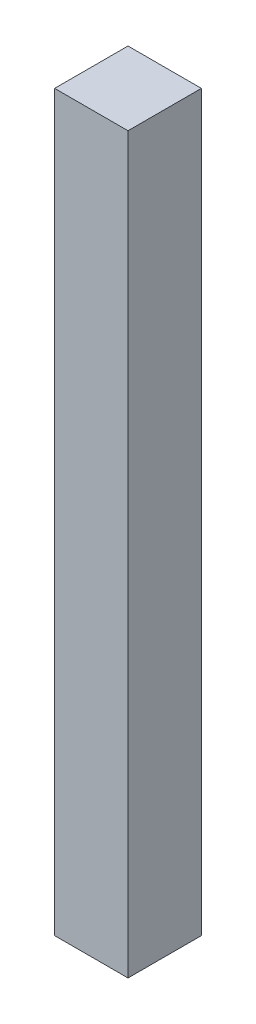
ISO-10303-21;
HEADER;
FILE_DESCRIPTION(('STEP AP214'),'2;1');
FILE_NAME('part.step','',(''),(''),'','','');
FILE_SCHEMA(('AUTOMOTIVE_DESIGN { 1 0 10303 214 1 1 1 1 }'));
ENDSEC;
DATA;
#1=APPLICATION_CONTEXT('core data for automotive mechanical design processes');
#2=APPLICATION_PROTOCOL_DEFINITION('international standard','automotive_design',2000,#1);
#3=PRODUCT_CONTEXT('',#1,'mechanical');
#4=PRODUCT('Part','Part','',(#3));
#5=PRODUCT_RELATED_PRODUCT_CATEGORY('part','',(#4));
#6=PRODUCT_DEFINITION_FORMATION('','',#4);
#7=PRODUCT_DEFINITION_CONTEXT('part definition',#1,'design');
#8=PRODUCT_DEFINITION('design','',#6,#7);
#9=PRODUCT_DEFINITION_SHAPE('','',#8);
#10=(LENGTH_UNIT() NAMED_UNIT(*) SI_UNIT(.MILLI.,.METRE.));
#11=(NAMED_UNIT(*) PLANE_ANGLE_UNIT() SI_UNIT($,.RADIAN.));
#12=(NAMED_UNIT(*) SI_UNIT($,.STERADIAN.) SOLID_ANGLE_UNIT());
#13=UNCERTAINTY_MEASURE_WITH_UNIT(LENGTH_MEASURE(1.E-05),#10,'distance_accuracy_value','');
#14=(GEOMETRIC_REPRESENTATION_CONTEXT(3) GLOBAL_UNCERTAINTY_ASSIGNED_CONTEXT((#13)) GLOBAL_UNIT_ASSIGNED_CONTEXT((#10,
#11,#12)) REPRESENTATION_CONTEXT('',''));
#15=CARTESIAN_POINT('',(0.,0.,0.));
#16=DIRECTION('',(0.,0.,1.));
#17=DIRECTION('',(1.,0.,0.));
#18=AXIS2_PLACEMENT_3D('',#15,#16,#17);
#19=CARTESIAN_POINT('',(0.,1000.,0.));
#20=DIRECTION('',(1.,0.,0.));
#21=DIRECTION('',(0.,0.,-1.));
#22=AXIS2_PLACEMENT_3D('',#19,#20,#21);
#23=PLANE('',#22);
#24=DIRECTION('',(0.,0.,1.));
#25=VECTOR('',#24,1.);
#26=CARTESIAN_POINT('',(0.,0.,0.));
#27=LINE('',#26,#25);
#28=CARTESIAN_POINT('',(0.,0.,-100.));
#29=VERTEX_POINT('',#28);
#30=CARTESIAN_POINT('',(0.,0.,0.));
#31=VERTEX_POINT('',#30);
#32=EDGE_CURVE('E96',#29,#31,#27,.T.);
#33=ORIENTED_EDGE('',*,*,#32,.T.);
#34=DIRECTION('',(0.,-1.,0.));
#35=VECTOR('',#34,1.);
#36=CARTESIAN_POINT('',(0.,1000.,0.));
#37=LINE('',#36,#35);
#38=CARTESIAN_POINT('',(0.,1000.,0.));
#39=VERTEX_POINT('',#38);
#40=EDGE_CURVE('E11',#39,#31,#37,.T.);
#41=ORIENTED_EDGE('',*,*,#40,.F.);
#42=DIRECTION('',(0.,0.,1.));
#43=VECTOR('',#42,1.);
#44=CARTESIAN_POINT('',(0.,1000.,0.));
#45=LINE('',#44,#43);
#46=CARTESIAN_POINT('',(0.,1000.,-100.));
#47=VERTEX_POINT('',#46);
#48=EDGE_CURVE('E84',#47,#39,#45,.T.);
#49=ORIENTED_EDGE('',*,*,#48,.F.);
#50=DIRECTION('',(0.,-1.,0.));
#51=VECTOR('',#50,1.);
#52=CARTESIAN_POINT('',(0.,1000.,-100.));
#53=LINE('',#52,#51);
#54=EDGE_CURVE('E92',#47,#29,#53,.T.);
#55=ORIENTED_EDGE('',*,*,#54,.T.);
#56=EDGE_LOOP('',(#33,#41,#49,#55));
#57=FACE_BOUND('',#56,.T.);
#58=ADVANCED_FACE('F33',(#57),#23,.F.);
#59=CARTESIAN_POINT('',(0.,1000.,0.));
#60=DIRECTION('',(0.,0.,-1.));
#61=DIRECTION('',(-1.,0.,0.));
#62=AXIS2_PLACEMENT_3D('',#59,#60,#61);
#63=PLANE('',#62);
#64=DIRECTION('',(1.,0.,0.));
#65=VECTOR('',#64,1.);
#66=CARTESIAN_POINT('',(0.,0.,0.));
#67=LINE('',#66,#65);
#68=CARTESIAN_POINT('',(100.,0.,0.));
#69=VERTEX_POINT('',#68);
#70=EDGE_CURVE('E88',#31,#69,#67,.T.);
#71=ORIENTED_EDGE('',*,*,#70,.T.);
#72=DIRECTION('',(0.,-1.,0.));
#73=VECTOR('',#72,1.);
#74=CARTESIAN_POINT('',(100.,1000.,0.));
#75=LINE('',#74,#73);
#76=CARTESIAN_POINT('',(100.,1000.,0.));
#77=VERTEX_POINT('',#76);
#78=EDGE_CURVE('E41',#77,#69,#75,.T.);
#79=ORIENTED_EDGE('',*,*,#78,.F.);
#80=DIRECTION('',(1.,0.,0.));
#81=VECTOR('',#80,1.);
#82=CARTESIAN_POINT('',(0.,1000.,0.));
#83=LINE('',#82,#81);
#84=EDGE_CURVE('E79',#39,#77,#83,.T.);
#85=ORIENTED_EDGE('',*,*,#84,.F.);
#86=ORIENTED_EDGE('',*,*,#40,.T.);
#87=EDGE_LOOP('',(#71,#79,#85,#86));
#88=FACE_BOUND('',#87,.T.);
#89=ADVANCED_FACE('F87',(#88),#63,.F.);
#90=CARTESIAN_POINT('',(100.,1000.,0.));
#91=DIRECTION('',(-1.,0.,0.));
#92=DIRECTION('',(0.,0.,1.));
#93=AXIS2_PLACEMENT_3D('',#90,#91,#92);
#94=PLANE('',#93);
#95=DIRECTION('',(0.,0.,-1.));
#96=VECTOR('',#95,1.);
#97=CARTESIAN_POINT('',(100.,0.,0.));
#98=LINE('',#97,#96);
#99=CARTESIAN_POINT('',(100.,0.,-100.));
#100=VERTEX_POINT('',#99);
#101=EDGE_CURVE('E66',#69,#100,#98,.T.);
#102=ORIENTED_EDGE('',*,*,#101,.T.);
#103=DIRECTION('',(0.,-1.,0.));
#104=VECTOR('',#103,1.);
#105=CARTESIAN_POINT('',(100.,1000.,-100.));
#106=LINE('',#105,#104);
#107=CARTESIAN_POINT('',(100.,1000.,-100.));
#108=VERTEX_POINT('',#107);
#109=EDGE_CURVE('E89',#108,#100,#106,.T.);
#110=ORIENTED_EDGE('',*,*,#109,.F.);
#111=DIRECTION('',(0.,0.,-1.));
#112=VECTOR('',#111,1.);
#113=CARTESIAN_POINT('',(100.,1000.,0.));
#114=LINE('',#113,#112);
#115=EDGE_CURVE('E82',#77,#108,#114,.T.);
#116=ORIENTED_EDGE('',*,*,#115,.F.);
#117=ORIENTED_EDGE('',*,*,#78,.T.);
#118=EDGE_LOOP('',(#102,#110,#116,#117));
#119=FACE_BOUND('',#118,.T.);
#120=ADVANCED_FACE('F90',(#119),#94,.F.);
#121=CARTESIAN_POINT('',(0.,1000.,-100.));
#122=DIRECTION('',(0.,0.,1.));
#123=DIRECTION('',(1.,0.,0.));
#124=AXIS2_PLACEMENT_3D('',#121,#122,#123);
#125=PLANE('',#124);
#126=DIRECTION('',(-1.,0.,0.));
#127=VECTOR('',#126,1.);
#128=CARTESIAN_POINT('',(0.,0.,-100.));
#129=LINE('',#128,#127);
#130=EDGE_CURVE('E72',#100,#29,#129,.T.);
#131=ORIENTED_EDGE('',*,*,#130,.T.);
#132=ORIENTED_EDGE('',*,*,#54,.F.);
#133=DIRECTION('',(-1.,0.,0.));
#134=VECTOR('',#133,1.);
#135=CARTESIAN_POINT('',(0.,1000.,-100.));
#136=LINE('',#135,#134);
#137=EDGE_CURVE('E49',#108,#47,#136,.T.);
#138=ORIENTED_EDGE('',*,*,#137,.F.);
#139=ORIENTED_EDGE('',*,*,#109,.T.);
#140=EDGE_LOOP('',(#131,#132,#138,#139));
#141=FACE_BOUND('',#140,.T.);
#142=ADVANCED_FACE('F103',(#141),#125,.F.);
#143=CARTESIAN_POINT('',(0.,1000.,0.));
#144=DIRECTION('',(0.,-1.,0.));
#145=DIRECTION('',(0.,0.,-1.));
#146=AXIS2_PLACEMENT_3D('',#143,#144,#145);
#147=PLANE('',#146);
#148=ORIENTED_EDGE('',*,*,#48,.T.);
#149=ORIENTED_EDGE('',*,*,#84,.T.);
#150=ORIENTED_EDGE('',*,*,#115,.T.);
#151=ORIENTED_EDGE('',*,*,#137,.T.);
#152=EDGE_LOOP('',(#148,#149,#150,#151));
#153=FACE_BOUND('',#152,.T.);
#154=ADVANCED_FACE('F80',(#153),#147,.F.);
#155=CARTESIAN_POINT('',(0.,0.,0.));
#156=DIRECTION('',(0.,-1.,0.));
#157=DIRECTION('',(0.,0.,-1.));
#158=AXIS2_PLACEMENT_3D('',#155,#156,#157);
#159=PLANE('',#158);
#160=ORIENTED_EDGE('',*,*,#32,.F.);
#161=ORIENTED_EDGE('',*,*,#130,.F.);
#162=ORIENTED_EDGE('',*,*,#101,.F.);
#163=ORIENTED_EDGE('',*,*,#70,.F.);
#164=EDGE_LOOP('',(#160,#161,#162,#163));
#165=FACE_BOUND('',#164,.T.);
#166=ADVANCED_FACE('F106',(#165),#159,.T.);
#167=CLOSED_SHELL('',(#58,#89,#120,#142,#154,#166));
#168=MANIFOLD_SOLID_BREP('B2',#167);
#169=ADVANCED_BREP_SHAPE_REPRESENTATION('',(#18,#168),#14);
#170=SHAPE_DEFINITION_REPRESENTATION(#9,#169);
ENDSEC;
END-ISO-10303-21;
